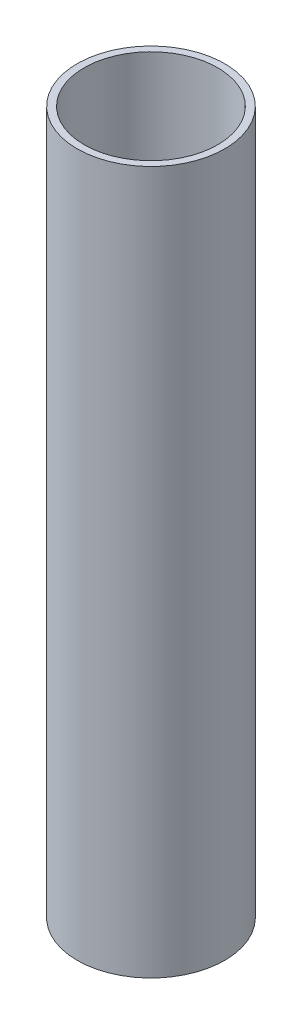
ISO-10303-21;
HEADER;
FILE_DESCRIPTION(('STEP AP214'),'2;1');
FILE_NAME('part.step','',(''),(''),'','','');
FILE_SCHEMA(('AUTOMOTIVE_DESIGN { 1 0 10303 214 1 1 1 1 }'));
ENDSEC;
DATA;
#1=APPLICATION_CONTEXT('core data for automotive mechanical design processes');
#2=APPLICATION_PROTOCOL_DEFINITION('international standard','automotive_design',2000,#1);
#3=PRODUCT_CONTEXT('',#1,'mechanical');
#4=PRODUCT('Part','Part','',(#3));
#5=PRODUCT_RELATED_PRODUCT_CATEGORY('part','',(#4));
#6=PRODUCT_DEFINITION_FORMATION('','',#4);
#7=PRODUCT_DEFINITION_CONTEXT('part definition',#1,'design');
#8=PRODUCT_DEFINITION('design','',#6,#7);
#9=PRODUCT_DEFINITION_SHAPE('','',#8);
#10=(LENGTH_UNIT() NAMED_UNIT(*) SI_UNIT(.MILLI.,.METRE.));
#11=(NAMED_UNIT(*) PLANE_ANGLE_UNIT() SI_UNIT($,.RADIAN.));
#12=(NAMED_UNIT(*) SI_UNIT($,.STERADIAN.) SOLID_ANGLE_UNIT());
#13=UNCERTAINTY_MEASURE_WITH_UNIT(LENGTH_MEASURE(1.E-05),#10,'distance_accuracy_value','');
#14=(GEOMETRIC_REPRESENTATION_CONTEXT(3) GLOBAL_UNCERTAINTY_ASSIGNED_CONTEXT((#13)) GLOBAL_UNIT_ASSIGNED_CONTEXT((#10,
#11,#12)) REPRESENTATION_CONTEXT('',''));
#15=CARTESIAN_POINT('',(0.,0.,0.));
#16=DIRECTION('',(0.,0.,1.));
#17=DIRECTION('',(1.,0.,0.));
#18=AXIS2_PLACEMENT_3D('',#15,#16,#17);
#19=CARTESIAN_POINT('',(0.,200.,0.));
#20=DIRECTION('',(0.,1.,0.));
#21=DIRECTION('',(0.,0.,1.));
#22=AXIS2_PLACEMENT_3D('',#19,#20,#21);
#23=PLANE('',#22);
#24=CARTESIAN_POINT('',(0.,200.,0.));
#25=DIRECTION('',(0.,1.,0.));
#26=DIRECTION('',(0.,0.,1.));
#27=AXIS2_PLACEMENT_3D('',#24,#25,#26);
#28=CIRCLE('',#27,21.);
#29=CARTESIAN_POINT('',(0.,200.,21.));
#30=VERTEX_POINT('',#29);
#31=EDGE_CURVE('E10',#30,#30,#28,.T.);
#32=ORIENTED_EDGE('',*,*,#31,.T.);
#33=EDGE_LOOP('',(#32));
#34=FACE_BOUND('',#33,.T.);
#35=CARTESIAN_POINT('',(0.,200.,0.));
#36=DIRECTION('',(0.,1.,0.));
#37=DIRECTION('',(0.,0.,1.));
#38=AXIS2_PLACEMENT_3D('',#35,#36,#37);
#39=CIRCLE('',#38,19.);
#40=CARTESIAN_POINT('',(0.,200.,19.));
#41=VERTEX_POINT('',#40);
#42=EDGE_CURVE('E50',#41,#41,#39,.T.);
#43=ORIENTED_EDGE('',*,*,#42,.F.);
#44=EDGE_LOOP('',(#43));
#45=FACE_BOUND('',#44,.T.);
#46=ADVANCED_FACE('F37',(#34,#45),#23,.T.);
#47=CARTESIAN_POINT('',(0.,0.,0.));
#48=DIRECTION('',(0.,1.,0.));
#49=DIRECTION('',(0.,0.,1.));
#50=AXIS2_PLACEMENT_3D('',#47,#48,#49);
#51=PLANE('',#50);
#52=CARTESIAN_POINT('',(0.,0.,0.));
#53=DIRECTION('',(0.,1.,0.));
#54=DIRECTION('',(0.,0.,1.));
#55=AXIS2_PLACEMENT_3D('',#52,#53,#54);
#56=CIRCLE('',#55,21.);
#57=CARTESIAN_POINT('',(0.,0.,21.));
#58=VERTEX_POINT('',#57);
#59=EDGE_CURVE('E41',#58,#58,#56,.T.);
#60=ORIENTED_EDGE('',*,*,#59,.F.);
#61=EDGE_LOOP('',(#60));
#62=FACE_BOUND('',#61,.T.);
#63=CARTESIAN_POINT('',(0.,0.,0.));
#64=DIRECTION('',(0.,1.,0.));
#65=DIRECTION('',(0.,0.,1.));
#66=AXIS2_PLACEMENT_3D('',#63,#64,#65);
#67=CIRCLE('',#66,19.);
#68=CARTESIAN_POINT('',(0.,0.,19.));
#69=VERTEX_POINT('',#68);
#70=EDGE_CURVE('E52',#69,#69,#67,.T.);
#71=ORIENTED_EDGE('',*,*,#70,.T.);
#72=EDGE_LOOP('',(#71));
#73=FACE_BOUND('',#72,.T.);
#74=ADVANCED_FACE('F64',(#62,#73),#51,.F.);
#75=CARTESIAN_POINT('',(0.,200.,0.));
#76=DIRECTION('',(0.,-1.,0.));
#77=DIRECTION('',(0.,0.,-1.));
#78=AXIS2_PLACEMENT_3D('',#75,#76,#77);
#79=CYLINDRICAL_SURFACE('',#78,21.);
#80=ORIENTED_EDGE('',*,*,#31,.F.);
#81=EDGE_LOOP('',(#80));
#82=FACE_BOUND('',#81,.T.);
#83=ORIENTED_EDGE('',*,*,#59,.T.);
#84=EDGE_LOOP('',(#83));
#85=FACE_BOUND('',#84,.T.);
#86=ADVANCED_FACE('F39',(#82,#85),#79,.T.);
#87=CARTESIAN_POINT('',(0.,200.,0.));
#88=DIRECTION('',(0.,-1.,0.));
#89=DIRECTION('',(0.,0.,-1.));
#90=AXIS2_PLACEMENT_3D('',#87,#88,#89);
#91=CYLINDRICAL_SURFACE('',#90,19.);
#92=ORIENTED_EDGE('',*,*,#42,.T.);
#93=EDGE_LOOP('',(#92));
#94=FACE_BOUND('',#93,.T.);
#95=ORIENTED_EDGE('',*,*,#70,.F.);
#96=EDGE_LOOP('',(#95));
#97=FACE_BOUND('',#96,.T.);
#98=ADVANCED_FACE('F60',(#94,#97),#91,.F.);
#99=CLOSED_SHELL('',(#46,#74,#86,#98));
#100=MANIFOLD_SOLID_BREP('B2',#99);
#101=ADVANCED_BREP_SHAPE_REPRESENTATION('',(#18,#100),#14);
#102=SHAPE_DEFINITION_REPRESENTATION(#9,#101);
ENDSEC;
END-ISO-10303-21;
